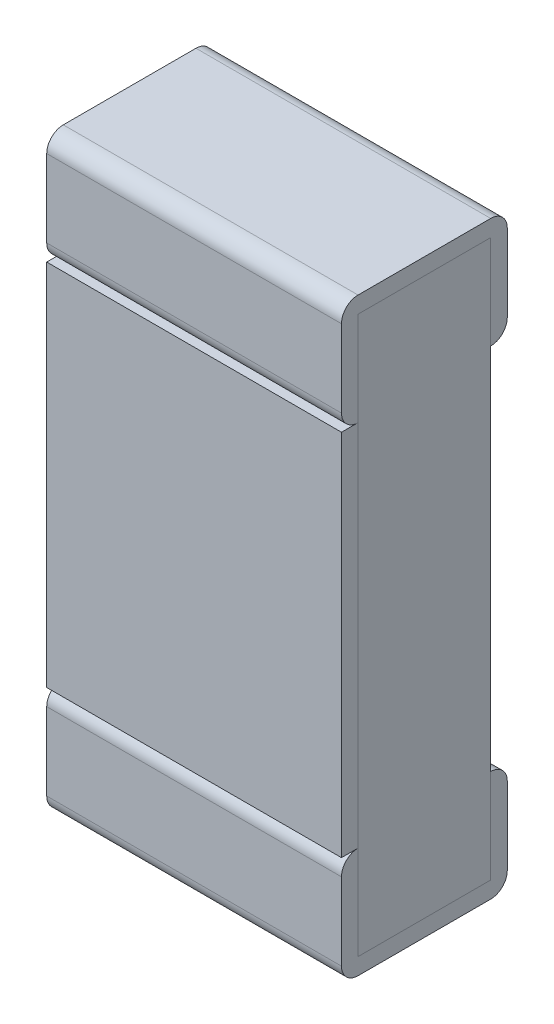
ISO-10303-21;
HEADER;
FILE_DESCRIPTION(('STEP AP214'),'2;1');
FILE_NAME('part.step','',(''),(''),'','','');
FILE_SCHEMA(('AUTOMOTIVE_DESIGN { 1 0 10303 214 1 1 1 1 }'));
ENDSEC;
DATA;
#1=APPLICATION_CONTEXT('core data for automotive mechanical design processes');
#2=APPLICATION_PROTOCOL_DEFINITION('international standard','automotive_design',2000,#1);
#3=PRODUCT_CONTEXT('',#1,'mechanical');
#4=PRODUCT('Part','Part','',(#3));
#5=PRODUCT_RELATED_PRODUCT_CATEGORY('part','',(#4));
#6=PRODUCT_DEFINITION_FORMATION('','',#4);
#7=PRODUCT_DEFINITION_CONTEXT('part definition',#1,'design');
#8=PRODUCT_DEFINITION('design','',#6,#7);
#9=PRODUCT_DEFINITION_SHAPE('','',#8);
#10=(LENGTH_UNIT() NAMED_UNIT(*) SI_UNIT(.MILLI.,.METRE.));
#11=(NAMED_UNIT(*) PLANE_ANGLE_UNIT() SI_UNIT($,.RADIAN.));
#12=(NAMED_UNIT(*) SI_UNIT($,.STERADIAN.) SOLID_ANGLE_UNIT());
#13=UNCERTAINTY_MEASURE_WITH_UNIT(LENGTH_MEASURE(1.E-05),#10,'distance_accuracy_value','');
#14=(GEOMETRIC_REPRESENTATION_CONTEXT(3) GLOBAL_UNCERTAINTY_ASSIGNED_CONTEXT((#13)) GLOBAL_UNIT_ASSIGNED_CONTEXT((#10,
#11,#12)) REPRESENTATION_CONTEXT('',''));
#15=CARTESIAN_POINT('',(0.,0.,0.));
#16=DIRECTION('',(0.,0.,1.));
#17=DIRECTION('',(1.,0.,0.));
#18=AXIS2_PLACEMENT_3D('',#15,#16,#17);
#19=CARTESIAN_POINT('',(148.430744279938,106.47204329235,142.661582908599));
#20=DIRECTION('',(0.,0.,1.));
#21=DIRECTION('',(1.,0.,0.));
#22=AXIS2_PLACEMENT_3D('',#19,#20,#21);
#23=PLANE('',#22);
#24=DIRECTION('',(1.,0.,0.));
#25=VECTOR('',#24,1.);
#26=CARTESIAN_POINT('',(148.430744279938,106.47204329235,142.661582908599));
#27=LINE('',#26,#25);
#28=CARTESIAN_POINT('',(148.430744279938,106.47204329235,142.661582908599));
#29=VERTEX_POINT('',#28);
#30=CARTESIAN_POINT('',(149.230744279938,106.47204329235,142.661582908599));
#31=VERTEX_POINT('',#30);
#32=EDGE_CURVE('E67',#29,#31,#27,.T.);
#33=ORIENTED_EDGE('',*,*,#32,.F.);
#34=DIRECTION('',(0.,-1.,0.));
#35=VECTOR('',#34,1.);
#36=CARTESIAN_POINT('',(148.430744279938,106.47204329235,142.661582908599));
#37=LINE('',#36,#35);
#38=CARTESIAN_POINT('',(148.430744279938,105.47204329235,142.661582908599));
#39=VERTEX_POINT('',#38);
#40=EDGE_CURVE('E11',#29,#39,#37,.T.);
#41=ORIENTED_EDGE('',*,*,#40,.T.);
#42=DIRECTION('',(1.,0.,0.));
#43=VECTOR('',#42,1.);
#44=CARTESIAN_POINT('',(148.430744279938,105.47204329235,142.661582908599));
#45=LINE('',#44,#43);
#46=CARTESIAN_POINT('',(149.230744279938,105.47204329235,142.661582908599));
#47=VERTEX_POINT('',#46);
#48=EDGE_CURVE('E55',#39,#47,#45,.T.);
#49=ORIENTED_EDGE('',*,*,#48,.T.);
#50=DIRECTION('',(0.,-1.,0.));
#51=VECTOR('',#50,1.);
#52=CARTESIAN_POINT('',(149.230744279938,106.47204329235,142.661582908599));
#53=LINE('',#52,#51);
#54=EDGE_CURVE('E330',#31,#47,#53,.T.);
#55=ORIENTED_EDGE('',*,*,#54,.F.);
#56=EDGE_LOOP('',(#33,#41,#49,#55));
#57=FACE_BOUND('',#56,.T.);
#58=ADVANCED_FACE('F44',(#57),#23,.T.);
#59=CARTESIAN_POINT('',(148.430744279938,105.47204329235,142.616582908599));
#60=DIRECTION('',(0.,-1.,0.));
#61=DIRECTION('',(0.,0.,-1.));
#62=AXIS2_PLACEMENT_3D('',#59,#60,#61);
#63=PLANE('',#62);
#64=DIRECTION('',(0.,0.,1.));
#65=VECTOR('',#64,1.);
#66=CARTESIAN_POINT('',(148.430744279938,105.47204329235,142.616582908599));
#67=LINE('',#66,#65);
#68=CARTESIAN_POINT('',(148.430744279938,105.47204329235,142.616582908599));
#69=VERTEX_POINT('',#68);
#70=EDGE_CURVE('E281',#69,#39,#67,.T.);
#71=ORIENTED_EDGE('',*,*,#70,.F.);
#72=DIRECTION('',(1.,0.,0.));
#73=VECTOR('',#72,1.);
#74=CARTESIAN_POINT('',(148.430744279938,105.47204329235,142.616582908599));
#75=LINE('',#74,#73);
#76=CARTESIAN_POINT('',(149.230744279938,105.47204329235,142.616582908599));
#77=VERTEX_POINT('',#76);
#78=EDGE_CURVE('E263',#69,#77,#75,.T.);
#79=ORIENTED_EDGE('',*,*,#78,.T.);
#80=DIRECTION('',(0.,0.,1.));
#81=VECTOR('',#80,1.);
#82=CARTESIAN_POINT('',(149.230744279938,105.47204329235,142.616582908599));
#83=LINE('',#82,#81);
#84=EDGE_CURVE('E259',#77,#47,#83,.T.);
#85=ORIENTED_EDGE('',*,*,#84,.T.);
#86=ORIENTED_EDGE('',*,*,#48,.F.);
#87=EDGE_LOOP('',(#71,#79,#85,#86));
#88=FACE_BOUND('',#87,.T.);
#89=ADVANCED_FACE('F528',(#88),#63,.T.);
#90=CARTESIAN_POINT('',(148.430744279938,105.42704329235,142.616582908599));
#91=DIRECTION('',(1.,0.,0.));
#92=DIRECTION('',(0.,1.,0.));
#93=AXIS2_PLACEMENT_3D('',#90,#91,#92);
#94=CYLINDRICAL_SURFACE('',#93,0.0450000000000034);
#95=CARTESIAN_POINT('',(148.430744279938,105.42704329235,142.616582908599));
#96=DIRECTION('',(1.,0.,0.));
#97=DIRECTION('',(0.,0.,1.));
#98=AXIS2_PLACEMENT_3D('',#95,#96,#97);
#99=CIRCLE('',#98,0.0449999999999895);
#100=CARTESIAN_POINT('',(148.430744279938,105.42704329235,142.661582908599));
#101=VERTEX_POINT('',#100);
#102=EDGE_CURVE('E264',#69,#101,#99,.T.);
#103=ORIENTED_EDGE('',*,*,#102,.T.);
#104=DIRECTION('',(1.,0.,0.));
#105=VECTOR('',#104,1.);
#106=CARTESIAN_POINT('',(148.430744279938,105.42704329235,142.661582908599));
#107=LINE('',#106,#105);
#108=CARTESIAN_POINT('',(149.230744279938,105.42704329235,142.661582908599));
#109=VERTEX_POINT('',#108);
#110=EDGE_CURVE('E338',#101,#109,#107,.T.);
#111=ORIENTED_EDGE('',*,*,#110,.T.);
#112=CARTESIAN_POINT('',(149.230744279938,105.42704329235,142.616582908599));
#113=DIRECTION('',(1.,0.,0.));
#114=DIRECTION('',(0.,0.,1.));
#115=AXIS2_PLACEMENT_3D('',#112,#113,#114);
#116=CIRCLE('',#115,0.0449999999999895);
#117=EDGE_CURVE('E254',#77,#109,#116,.T.);
#118=ORIENTED_EDGE('',*,*,#117,.F.);
#119=ORIENTED_EDGE('',*,*,#78,.F.);
#120=EDGE_LOOP('',(#103,#111,#118,#119));
#121=FACE_BOUND('',#120,.T.);
#122=ADVANCED_FACE('F578',(#121),#94,.T.);
#123=CARTESIAN_POINT('',(148.430744279938,105.47204329235,142.661582908599));
#124=DIRECTION('',(0.,0.,1.));
#125=DIRECTION('',(1.,0.,0.));
#126=AXIS2_PLACEMENT_3D('',#123,#124,#125);
#127=PLANE('',#126);
#128=DIRECTION('',(0.,-1.,0.));
#129=VECTOR('',#128,1.);
#130=CARTESIAN_POINT('',(149.230744279938,105.47204329235,142.661582908599));
#131=LINE('',#130,#129);
#132=CARTESIAN_POINT('',(149.230744279938,105.21704329235,142.661582908599));
#133=VERTEX_POINT('',#132);
#134=EDGE_CURVE('E258',#109,#133,#131,.T.);
#135=ORIENTED_EDGE('',*,*,#134,.F.);
#136=ORIENTED_EDGE('',*,*,#110,.F.);
#137=DIRECTION('',(0.,-1.,0.));
#138=VECTOR('',#137,1.);
#139=CARTESIAN_POINT('',(148.430744279938,105.47204329235,142.661582908599));
#140=LINE('',#139,#138);
#141=CARTESIAN_POINT('',(148.430744279938,105.21704329235,142.661582908599));
#142=VERTEX_POINT('',#141);
#143=EDGE_CURVE('E375',#101,#142,#140,.T.);
#144=ORIENTED_EDGE('',*,*,#143,.T.);
#145=DIRECTION('',(1.,0.,0.));
#146=VECTOR('',#145,1.);
#147=CARTESIAN_POINT('',(148.430744279938,105.21704329235,142.661582908599));
#148=LINE('',#147,#146);
#149=EDGE_CURVE('E269',#142,#133,#148,.T.);
#150=ORIENTED_EDGE('',*,*,#149,.T.);
#151=EDGE_LOOP('',(#135,#136,#144,#150));
#152=FACE_BOUND('',#151,.T.);
#153=ADVANCED_FACE('F580',(#152),#127,.T.);
#154=CARTESIAN_POINT('',(148.430744279938,105.21704329235,142.616582908599));
#155=DIRECTION('',(1.,0.,0.));
#156=DIRECTION('',(0.,-1.,0.));
#157=AXIS2_PLACEMENT_3D('',#154,#155,#156);
#158=CYLINDRICAL_SURFACE('',#157,0.0450000000000034);
#159=DIRECTION('',(1.,0.,0.));
#160=VECTOR('',#159,1.);
#161=CARTESIAN_POINT('',(148.430744279938,105.17204329235,142.616582908599));
#162=LINE('',#161,#160);
#163=CARTESIAN_POINT('',(148.430744279938,105.17204329235,142.616582908599));
#164=VERTEX_POINT('',#163);
#165=CARTESIAN_POINT('',(149.230744279938,105.17204329235,142.616582908599));
#166=VERTEX_POINT('',#165);
#167=EDGE_CURVE('E265',#164,#166,#162,.T.);
#168=ORIENTED_EDGE('',*,*,#167,.T.);
#169=CARTESIAN_POINT('',(149.230744279938,105.21704329235,142.616582908599));
#170=DIRECTION('',(-1.,0.,0.));
#171=DIRECTION('',(0.,0.,1.));
#172=AXIS2_PLACEMENT_3D('',#169,#170,#171);
#173=CIRCLE('',#172,0.0449999999999895);
#174=EDGE_CURVE('E270',#166,#133,#173,.T.);
#175=ORIENTED_EDGE('',*,*,#174,.T.);
#176=ORIENTED_EDGE('',*,*,#149,.F.);
#177=CARTESIAN_POINT('',(148.430744279938,105.21704329235,142.616582908599));
#178=DIRECTION('',(-1.,0.,0.));
#179=DIRECTION('',(0.,0.,1.));
#180=AXIS2_PLACEMENT_3D('',#177,#178,#179);
#181=CIRCLE('',#180,0.0449999999999895);
#182=EDGE_CURVE('E295',#164,#142,#181,.T.);
#183=ORIENTED_EDGE('',*,*,#182,.F.);
#184=EDGE_LOOP('',(#168,#175,#176,#183));
#185=FACE_BOUND('',#184,.T.);
#186=ADVANCED_FACE('F560',(#185),#158,.T.);
#187=CARTESIAN_POINT('',(148.430744279938,105.17204329235,142.211582908599));
#188=DIRECTION('',(0.,-1.,0.));
#189=DIRECTION('',(0.,0.,-1.));
#190=AXIS2_PLACEMENT_3D('',#187,#188,#189);
#191=PLANE('',#190);
#192=DIRECTION('',(0.,0.,1.));
#193=VECTOR('',#192,1.);
#194=CARTESIAN_POINT('',(148.430744279938,105.17204329235,142.211582908599));
#195=LINE('',#194,#193);
#196=CARTESIAN_POINT('',(148.430744279938,105.17204329235,142.256582908599));
#197=VERTEX_POINT('',#196);
#198=EDGE_CURVE('E282',#197,#164,#195,.T.);
#199=ORIENTED_EDGE('',*,*,#198,.F.);
#200=DIRECTION('',(1.,0.,0.));
#201=VECTOR('',#200,1.);
#202=CARTESIAN_POINT('',(148.430744279938,105.17204329235,142.256582908599));
#203=LINE('',#202,#201);
#204=CARTESIAN_POINT('',(149.230744279938,105.17204329235,142.256582908599));
#205=VERTEX_POINT('',#204);
#206=EDGE_CURVE('E308',#197,#205,#203,.T.);
#207=ORIENTED_EDGE('',*,*,#206,.T.);
#208=DIRECTION('',(0.,0.,1.));
#209=VECTOR('',#208,1.);
#210=CARTESIAN_POINT('',(149.230744279938,105.17204329235,142.211582908599));
#211=LINE('',#210,#209);
#212=EDGE_CURVE('E355',#205,#166,#211,.T.);
#213=ORIENTED_EDGE('',*,*,#212,.T.);
#214=ORIENTED_EDGE('',*,*,#167,.F.);
#215=EDGE_LOOP('',(#199,#207,#213,#214));
#216=FACE_BOUND('',#215,.T.);
#217=ADVANCED_FACE('F564',(#216),#191,.T.);
#218=CARTESIAN_POINT('',(148.430744279938,105.21704329235,142.256582908599));
#219=DIRECTION('',(1.,0.,0.));
#220=DIRECTION('',(0.,-1.,0.));
#221=AXIS2_PLACEMENT_3D('',#218,#219,#220);
#222=CYLINDRICAL_SURFACE('',#221,0.0450000000000034);
#223=CARTESIAN_POINT('',(148.430744279938,105.21704329235,142.256582908599));
#224=DIRECTION('',(1.,0.,0.));
#225=DIRECTION('',(0.,0.,1.));
#226=AXIS2_PLACEMENT_3D('',#223,#224,#225);
#227=CIRCLE('',#226,0.0449999999999895);
#228=CARTESIAN_POINT('',(148.430744279938,105.21704329235,142.211582908599));
#229=VERTEX_POINT('',#228);
#230=EDGE_CURVE('E389',#197,#229,#227,.T.);
#231=ORIENTED_EDGE('',*,*,#230,.T.);
#232=DIRECTION('',(1.,0.,0.));
#233=VECTOR('',#232,1.);
#234=CARTESIAN_POINT('',(148.430744279938,105.21704329235,142.211582908599));
#235=LINE('',#234,#233);
#236=CARTESIAN_POINT('',(149.230744279938,105.21704329235,142.211582908599));
#237=VERTEX_POINT('',#236);
#238=EDGE_CURVE('E366',#229,#237,#235,.T.);
#239=ORIENTED_EDGE('',*,*,#238,.T.);
#240=CARTESIAN_POINT('',(149.230744279938,105.21704329235,142.256582908599));
#241=DIRECTION('',(1.,0.,0.));
#242=DIRECTION('',(0.,0.,1.));
#243=AXIS2_PLACEMENT_3D('',#240,#241,#242);
#244=CIRCLE('',#243,0.0449999999999895);
#245=EDGE_CURVE('E374',#205,#237,#244,.T.);
#246=ORIENTED_EDGE('',*,*,#245,.F.);
#247=ORIENTED_EDGE('',*,*,#206,.F.);
#248=EDGE_LOOP('',(#231,#239,#246,#247));
#249=FACE_BOUND('',#248,.T.);
#250=ADVANCED_FACE('F422',(#249),#222,.T.);
#251=CARTESIAN_POINT('',(148.430744279938,105.47204329235,142.211582908599));
#252=DIRECTION('',(0.,0.,1.));
#253=DIRECTION('',(1.,0.,0.));
#254=AXIS2_PLACEMENT_3D('',#251,#252,#253);
#255=PLANE('',#254);
#256=ORIENTED_EDGE('',*,*,#238,.F.);
#257=DIRECTION('',(0.,-1.,0.));
#258=VECTOR('',#257,1.);
#259=CARTESIAN_POINT('',(148.430744279938,105.47204329235,142.211582908599));
#260=LINE('',#259,#258);
#261=CARTESIAN_POINT('',(148.430744279938,105.42704329235,142.211582908599));
#262=VERTEX_POINT('',#261);
#263=EDGE_CURVE('E309',#262,#229,#260,.T.);
#264=ORIENTED_EDGE('',*,*,#263,.F.);
#265=DIRECTION('',(1.,0.,0.));
#266=VECTOR('',#265,1.);
#267=CARTESIAN_POINT('',(148.430744279938,105.42704329235,142.211582908599));
#268=LINE('',#267,#266);
#269=CARTESIAN_POINT('',(149.230744279938,105.42704329235,142.211582908599));
#270=VERTEX_POINT('',#269);
#271=EDGE_CURVE('E362',#262,#270,#268,.T.);
#272=ORIENTED_EDGE('',*,*,#271,.T.);
#273=DIRECTION('',(0.,-1.,0.));
#274=VECTOR('',#273,1.);
#275=CARTESIAN_POINT('',(149.230744279938,105.47204329235,142.211582908599));
#276=LINE('',#275,#274);
#277=EDGE_CURVE('E367',#270,#237,#276,.T.);
#278=ORIENTED_EDGE('',*,*,#277,.T.);
#279=EDGE_LOOP('',(#256,#264,#272,#278));
#280=FACE_BOUND('',#279,.T.);
#281=ADVANCED_FACE('F431',(#280),#255,.F.);
#282=CARTESIAN_POINT('',(148.430744279938,105.42704329235,142.256582908599));
#283=DIRECTION('',(1.,0.,0.));
#284=DIRECTION('',(0.,1.,0.));
#285=AXIS2_PLACEMENT_3D('',#282,#283,#284);
#286=CYLINDRICAL_SURFACE('',#285,0.0450000000000034);
#287=DIRECTION('',(1.,0.,0.));
#288=VECTOR('',#287,1.);
#289=CARTESIAN_POINT('',(148.430744279938,105.47204329235,142.256582908599));
#290=LINE('',#289,#288);
#291=CARTESIAN_POINT('',(148.430744279938,105.47204329235,142.256582908599));
#292=VERTEX_POINT('',#291);
#293=CARTESIAN_POINT('',(149.230744279938,105.47204329235,142.256582908599));
#294=VERTEX_POINT('',#293);
#295=EDGE_CURVE('E325',#292,#294,#290,.T.);
#296=ORIENTED_EDGE('',*,*,#295,.T.);
#297=CARTESIAN_POINT('',(149.230744279938,105.42704329235,142.256582908599));
#298=DIRECTION('',(-1.,0.,0.));
#299=DIRECTION('',(0.,0.,1.));
#300=AXIS2_PLACEMENT_3D('',#297,#298,#299);
#301=CIRCLE('',#300,0.0449999999999895);
#302=EDGE_CURVE('E321',#294,#270,#301,.T.);
#303=ORIENTED_EDGE('',*,*,#302,.T.);
#304=ORIENTED_EDGE('',*,*,#271,.F.);
#305=CARTESIAN_POINT('',(148.430744279938,105.42704329235,142.256582908599));
#306=DIRECTION('',(-1.,0.,0.));
#307=DIRECTION('',(0.,0.,1.));
#308=AXIS2_PLACEMENT_3D('',#305,#306,#307);
#309=CIRCLE('',#308,0.0449999999999895);
#310=EDGE_CURVE('E313',#292,#262,#309,.T.);
#311=ORIENTED_EDGE('',*,*,#310,.F.);
#312=EDGE_LOOP('',(#296,#303,#304,#311));
#313=FACE_BOUND('',#312,.T.);
#314=ADVANCED_FACE('F470',(#313),#286,.T.);
#315=CARTESIAN_POINT('',(149.230744279938,106.47204329235,142.616582908599));
#316=DIRECTION('',(1.,0.,0.));
#317=DIRECTION('',(0.,1.,0.));
#318=AXIS2_PLACEMENT_3D('',#315,#316,#317);
#319=PLANE('',#318);
#320=DIRECTION('',(0.,-1.,0.));
#321=VECTOR('',#320,1.);
#322=CARTESIAN_POINT('',(149.230744279938,106.47204329235,142.616582908599));
#323=LINE('',#322,#321);
#324=CARTESIAN_POINT('',(149.230744279938,106.47204329235,142.616582908599));
#325=VERTEX_POINT('',#324);
#326=EDGE_CURVE('E339',#325,#77,#323,.T.);
#327=ORIENTED_EDGE('',*,*,#326,.F.);
#328=DIRECTION('',(0.,0.,1.));
#329=VECTOR('',#328,1.);
#330=CARTESIAN_POINT('',(149.230744279938,106.47204329235,142.616582908599));
#331=LINE('',#330,#329);
#332=EDGE_CURVE('E326',#325,#31,#331,.T.);
#333=ORIENTED_EDGE('',*,*,#332,.T.);
#334=ORIENTED_EDGE('',*,*,#54,.T.);
#335=ORIENTED_EDGE('',*,*,#84,.F.);
#336=EDGE_LOOP('',(#327,#333,#334,#335));
#337=FACE_BOUND('',#336,.T.);
#338=ADVANCED_FACE('F532',(#337),#319,.T.);
#339=CARTESIAN_POINT('',(149.230744279938,105.47204329235,142.211582908599));
#340=DIRECTION('',(1.,0.,0.));
#341=DIRECTION('',(0.,1.,0.));
#342=AXIS2_PLACEMENT_3D('',#339,#340,#341);
#343=PLANE('',#342);
#344=ORIENTED_EDGE('',*,*,#277,.F.);
#345=ORIENTED_EDGE('',*,*,#302,.F.);
#346=DIRECTION('',(0.,-1.,0.));
#347=VECTOR('',#346,1.);
#348=CARTESIAN_POINT('',(149.230744279938,106.72704329235,142.256582908599));
#349=LINE('',#348,#347);
#350=CARTESIAN_POINT('',(149.230744279938,105.21704329235,142.256582908599));
#351=VERTEX_POINT('',#350);
#352=EDGE_CURVE('E161',#294,#351,#349,.T.);
#353=ORIENTED_EDGE('',*,*,#352,.T.);
#354=DIRECTION('',(0.,0.,1.));
#355=VECTOR('',#354,1.);
#356=CARTESIAN_POINT('',(149.230744279938,105.21704329235,142.256582908599));
#357=LINE('',#356,#355);
#358=CARTESIAN_POINT('',(149.230744279938,105.21704329235,142.616582908599));
#359=VERTEX_POINT('',#358);
#360=EDGE_CURVE('E257',#351,#359,#357,.T.);
#361=ORIENTED_EDGE('',*,*,#360,.T.);
#362=DIRECTION('',(0.,-1.,0.));
#363=VECTOR('',#362,1.);
#364=CARTESIAN_POINT('',(149.230744279938,106.72704329235,142.616582908599));
#365=LINE('',#364,#363);
#366=EDGE_CURVE('E343',#77,#359,#365,.T.);
#367=ORIENTED_EDGE('',*,*,#366,.F.);
#368=ORIENTED_EDGE('',*,*,#117,.T.);
#369=ORIENTED_EDGE('',*,*,#134,.T.);
#370=ORIENTED_EDGE('',*,*,#174,.F.);
#371=ORIENTED_EDGE('',*,*,#212,.F.);
#372=ORIENTED_EDGE('',*,*,#245,.T.);
#373=EDGE_LOOP('',(#344,#345,#353,#361,#367,#368,#369,#370,#371,#372));
#374=FACE_BOUND('',#373,.T.);
#375=ADVANCED_FACE('F581',(#374),#343,.T.);
#376=CARTESIAN_POINT('',(148.430744279938,106.47204329235,142.616582908599));
#377=DIRECTION('',(0.,-1.,0.));
#378=DIRECTION('',(0.,0.,-1.));
#379=AXIS2_PLACEMENT_3D('',#376,#377,#378);
#380=PLANE('',#379);
#381=ORIENTED_EDGE('',*,*,#32,.T.);
#382=ORIENTED_EDGE('',*,*,#332,.F.);
#383=DIRECTION('',(1.,0.,0.));
#384=VECTOR('',#383,1.);
#385=CARTESIAN_POINT('',(148.430744279938,106.47204329235,142.616582908599));
#386=LINE('',#385,#384);
#387=CARTESIAN_POINT('',(148.430744279938,106.47204329235,142.616582908599));
#388=VERTEX_POINT('',#387);
#389=EDGE_CURVE('E149',#388,#325,#386,.T.);
#390=ORIENTED_EDGE('',*,*,#389,.F.);
#391=DIRECTION('',(0.,0.,1.));
#392=VECTOR('',#391,1.);
#393=CARTESIAN_POINT('',(148.430744279938,106.47204329235,142.616582908599));
#394=LINE('',#393,#392);
#395=EDGE_CURVE('E291',#388,#29,#394,.T.);
#396=ORIENTED_EDGE('',*,*,#395,.T.);
#397=EDGE_LOOP('',(#381,#382,#390,#396));
#398=FACE_BOUND('',#397,.T.);
#399=ADVANCED_FACE('F524',(#398),#380,.F.);
#400=CARTESIAN_POINT('',(148.430744279938,106.47204329235,142.616582908599));
#401=DIRECTION('',(1.,0.,0.));
#402=DIRECTION('',(0.,1.,0.));
#403=AXIS2_PLACEMENT_3D('',#400,#401,#402);
#404=PLANE('',#403);
#405=ORIENTED_EDGE('',*,*,#70,.T.);
#406=ORIENTED_EDGE('',*,*,#40,.F.);
#407=ORIENTED_EDGE('',*,*,#395,.F.);
#408=DIRECTION('',(0.,-1.,0.));
#409=VECTOR('',#408,1.);
#410=CARTESIAN_POINT('',(148.430744279938,106.47204329235,142.616582908599));
#411=LINE('',#410,#409);
#412=EDGE_CURVE('E278',#388,#69,#411,.T.);
#413=ORIENTED_EDGE('',*,*,#412,.T.);
#414=EDGE_LOOP('',(#405,#406,#407,#413));
#415=FACE_BOUND('',#414,.T.);
#416=ADVANCED_FACE('F525',(#415),#404,.F.);
#417=CARTESIAN_POINT('',(148.430744279938,105.47204329235,142.211582908599));
#418=DIRECTION('',(1.,0.,0.));
#419=DIRECTION('',(0.,1.,0.));
#420=AXIS2_PLACEMENT_3D('',#417,#418,#419);
#421=PLANE('',#420);
#422=ORIENTED_EDGE('',*,*,#230,.F.);
#423=ORIENTED_EDGE('',*,*,#198,.T.);
#424=ORIENTED_EDGE('',*,*,#182,.T.);
#425=ORIENTED_EDGE('',*,*,#143,.F.);
#426=ORIENTED_EDGE('',*,*,#102,.F.);
#427=DIRECTION('',(0.,-1.,0.));
#428=VECTOR('',#427,1.);
#429=CARTESIAN_POINT('',(148.430744279938,106.72704329235,142.616582908599));
#430=LINE('',#429,#428);
#431=CARTESIAN_POINT('',(148.430744279938,105.21704329235,142.616582908599));
#432=VERTEX_POINT('',#431);
#433=EDGE_CURVE('E217',#69,#432,#430,.T.);
#434=ORIENTED_EDGE('',*,*,#433,.T.);
#435=DIRECTION('',(0.,0.,1.));
#436=VECTOR('',#435,1.);
#437=CARTESIAN_POINT('',(148.430744279938,105.21704329235,142.256582908599));
#438=LINE('',#437,#436);
#439=CARTESIAN_POINT('',(148.430744279938,105.21704329235,142.256582908599));
#440=VERTEX_POINT('',#439);
#441=EDGE_CURVE('E208',#440,#432,#438,.T.);
#442=ORIENTED_EDGE('',*,*,#441,.F.);
#443=DIRECTION('',(0.,-1.,0.));
#444=VECTOR('',#443,1.);
#445=CARTESIAN_POINT('',(148.430744279938,106.72704329235,142.256582908599));
#446=LINE('',#445,#444);
#447=EDGE_CURVE('E213',#292,#440,#446,.T.);
#448=ORIENTED_EDGE('',*,*,#447,.F.);
#449=ORIENTED_EDGE('',*,*,#310,.T.);
#450=ORIENTED_EDGE('',*,*,#263,.T.);
#451=EDGE_LOOP('',(#422,#423,#424,#425,#426,#434,#442,#448,#449,#450));
#452=FACE_BOUND('',#451,.T.);
#453=ADVANCED_FACE('F211',(#452),#421,.F.);
#454=CARTESIAN_POINT('',(148.430744279938,106.72704329235,142.256582908599));
#455=DIRECTION('',(0.,0.,1.));
#456=DIRECTION('',(1.,0.,0.));
#457=AXIS2_PLACEMENT_3D('',#454,#455,#456);
#458=PLANE('',#457);
#459=DIRECTION('',(0.,-1.,0.));
#460=VECTOR('',#459,1.);
#461=CARTESIAN_POINT('',(149.230744279938,106.72704329235,142.256582908599));
#462=LINE('',#461,#460);
#463=CARTESIAN_POINT('',(149.230744279938,106.47204329235,142.256582908599));
#464=VERTEX_POINT('',#463);
#465=EDGE_CURVE('E314',#464,#294,#462,.T.);
#466=ORIENTED_EDGE('',*,*,#465,.T.);
#467=ORIENTED_EDGE('',*,*,#295,.F.);
#468=DIRECTION('',(0.,-1.,0.));
#469=VECTOR('',#468,1.);
#470=CARTESIAN_POINT('',(148.430744279938,106.72704329235,142.256582908599));
#471=LINE('',#470,#469);
#472=CARTESIAN_POINT('',(148.430744279938,106.47204329235,142.256582908599));
#473=VERTEX_POINT('',#472);
#474=EDGE_CURVE('E225',#473,#292,#471,.T.);
#475=ORIENTED_EDGE('',*,*,#474,.F.);
#476=DIRECTION('',(1.,0.,0.));
#477=VECTOR('',#476,1.);
#478=CARTESIAN_POINT('',(148.430744279938,106.47204329235,142.256582908599));
#479=LINE('',#478,#477);
#480=EDGE_CURVE('E403',#473,#464,#479,.T.);
#481=ORIENTED_EDGE('',*,*,#480,.T.);
#482=EDGE_LOOP('',(#466,#467,#475,#481));
#483=FACE_BOUND('',#482,.T.);
#484=ADVANCED_FACE('F472',(#483),#458,.F.);
#485=CARTESIAN_POINT('',(149.230744279938,106.72704329235,142.256582908599));
#486=DIRECTION('',(1.,0.,0.));
#487=DIRECTION('',(0.,1.,0.));
#488=AXIS2_PLACEMENT_3D('',#485,#486,#487);
#489=PLANE('',#488);
#490=DIRECTION('',(0.,-1.,0.));
#491=VECTOR('',#490,1.);
#492=CARTESIAN_POINT('',(149.230744279938,106.72704329235,142.256582908599));
#493=LINE('',#492,#491);
#494=CARTESIAN_POINT('',(149.230744279938,106.72704329235,142.256582908599));
#495=VERTEX_POINT('',#494);
#496=EDGE_CURVE('E247',#495,#464,#493,.T.);
#497=ORIENTED_EDGE('',*,*,#496,.F.);
#498=DIRECTION('',(0.,0.,1.));
#499=VECTOR('',#498,1.);
#500=CARTESIAN_POINT('',(149.230744279938,106.72704329235,142.256582908599));
#501=LINE('',#500,#499);
#502=CARTESIAN_POINT('',(149.230744279938,106.72704329235,142.616582908599));
#503=VERTEX_POINT('',#502);
#504=EDGE_CURVE('E399',#495,#503,#501,.T.);
#505=ORIENTED_EDGE('',*,*,#504,.T.);
#506=DIRECTION('',(0.,-1.,0.));
#507=VECTOR('',#506,1.);
#508=CARTESIAN_POINT('',(149.230744279938,106.72704329235,142.616582908599));
#509=LINE('',#508,#507);
#510=EDGE_CURVE('E342',#503,#325,#509,.T.);
#511=ORIENTED_EDGE('',*,*,#510,.T.);
#512=ORIENTED_EDGE('',*,*,#326,.T.);
#513=ORIENTED_EDGE('',*,*,#366,.T.);
#514=ORIENTED_EDGE('',*,*,#360,.F.);
#515=ORIENTED_EDGE('',*,*,#352,.F.);
#516=ORIENTED_EDGE('',*,*,#465,.F.);
#517=EDGE_LOOP('',(#497,#505,#511,#512,#513,#514,#515,#516));
#518=FACE_BOUND('',#517,.T.);
#519=ADVANCED_FACE('F478',(#518),#489,.T.);
#520=CARTESIAN_POINT('',(148.430744279938,106.51704329235,142.616582908599));
#521=DIRECTION('',(1.,0.,0.));
#522=DIRECTION('',(0.,-1.,0.));
#523=AXIS2_PLACEMENT_3D('',#520,#521,#522);
#524=CYLINDRICAL_SURFACE('',#523,0.0450000000000034);
#525=ORIENTED_EDGE('',*,*,#389,.T.);
#526=CARTESIAN_POINT('',(149.230744279938,106.51704329235,142.616582908599));
#527=DIRECTION('',(-1.,0.,0.));
#528=DIRECTION('',(0.,0.,1.));
#529=AXIS2_PLACEMENT_3D('',#526,#527,#528);
#530=CIRCLE('',#529,0.0449999999999895);
#531=CARTESIAN_POINT('',(149.230744279938,106.51704329235,142.661582908599));
#532=VERTEX_POINT('',#531);
#533=EDGE_CURVE('E407',#325,#532,#530,.T.);
#534=ORIENTED_EDGE('',*,*,#533,.T.);
#535=DIRECTION('',(1.,0.,0.));
#536=VECTOR('',#535,1.);
#537=CARTESIAN_POINT('',(148.430744279938,106.51704329235,142.661582908599));
#538=LINE('',#537,#536);
#539=CARTESIAN_POINT('',(148.430744279938,106.51704329235,142.661582908599));
#540=VERTEX_POINT('',#539);
#541=EDGE_CURVE('E232',#540,#532,#538,.T.);
#542=ORIENTED_EDGE('',*,*,#541,.F.);
#543=CARTESIAN_POINT('',(148.430744279938,106.51704329235,142.616582908599));
#544=DIRECTION('',(-1.,0.,0.));
#545=DIRECTION('',(0.,0.,1.));
#546=AXIS2_PLACEMENT_3D('',#543,#544,#545);
#547=CIRCLE('',#546,0.0449999999999895);
#548=EDGE_CURVE('E271',#388,#540,#547,.T.);
#549=ORIENTED_EDGE('',*,*,#548,.F.);
#550=EDGE_LOOP('',(#525,#534,#542,#549));
#551=FACE_BOUND('',#550,.T.);
#552=ADVANCED_FACE('F46',(#551),#524,.T.);
#553=CARTESIAN_POINT('',(148.430744279938,106.77204329235,142.661582908599));
#554=DIRECTION('',(0.,0.,1.));
#555=DIRECTION('',(1.,0.,0.));
#556=AXIS2_PLACEMENT_3D('',#553,#554,#555);
#557=PLANE('',#556);
#558=DIRECTION('',(0.,-1.,0.));
#559=VECTOR('',#558,1.);
#560=CARTESIAN_POINT('',(149.230744279938,106.77204329235,142.661582908599));
#561=LINE('',#560,#559);
#562=CARTESIAN_POINT('',(149.230744279938,106.72704329235,142.661582908599));
#563=VERTEX_POINT('',#562);
#564=EDGE_CURVE('E242',#563,#532,#561,.T.);
#565=ORIENTED_EDGE('',*,*,#564,.F.);
#566=DIRECTION('',(1.,0.,0.));
#567=VECTOR('',#566,1.);
#568=CARTESIAN_POINT('',(148.430744279938,106.72704329235,142.661582908599));
#569=LINE('',#568,#567);
#570=CARTESIAN_POINT('',(148.430744279938,106.72704329235,142.661582908599));
#571=VERTEX_POINT('',#570);
#572=EDGE_CURVE('E240',#571,#563,#569,.T.);
#573=ORIENTED_EDGE('',*,*,#572,.F.);
#574=DIRECTION('',(0.,-1.,0.));
#575=VECTOR('',#574,1.);
#576=CARTESIAN_POINT('',(148.430744279938,106.77204329235,142.661582908599));
#577=LINE('',#576,#575);
#578=EDGE_CURVE('E409',#571,#540,#577,.T.);
#579=ORIENTED_EDGE('',*,*,#578,.T.);
#580=ORIENTED_EDGE('',*,*,#541,.T.);
#581=EDGE_LOOP('',(#565,#573,#579,#580));
#582=FACE_BOUND('',#581,.T.);
#583=ADVANCED_FACE('F504',(#582),#557,.T.);
#584=CARTESIAN_POINT('',(148.430744279938,106.72704329235,142.256582908599));
#585=DIRECTION('',(1.,0.,0.));
#586=DIRECTION('',(0.,1.,0.));
#587=AXIS2_PLACEMENT_3D('',#584,#585,#586);
#588=PLANE('',#587);
#589=ORIENTED_EDGE('',*,*,#474,.T.);
#590=ORIENTED_EDGE('',*,*,#447,.T.);
#591=ORIENTED_EDGE('',*,*,#441,.T.);
#592=ORIENTED_EDGE('',*,*,#433,.F.);
#593=ORIENTED_EDGE('',*,*,#412,.F.);
#594=DIRECTION('',(0.,-1.,0.));
#595=VECTOR('',#594,1.);
#596=CARTESIAN_POINT('',(148.430744279938,106.72704329235,142.616582908599));
#597=LINE('',#596,#595);
#598=CARTESIAN_POINT('',(148.430744279938,106.72704329235,142.616582908599));
#599=VERTEX_POINT('',#598);
#600=EDGE_CURVE('E274',#599,#388,#597,.T.);
#601=ORIENTED_EDGE('',*,*,#600,.F.);
#602=DIRECTION('',(0.,0.,1.));
#603=VECTOR('',#602,1.);
#604=CARTESIAN_POINT('',(148.430744279938,106.72704329235,142.256582908599));
#605=LINE('',#604,#603);
#606=CARTESIAN_POINT('',(148.430744279938,106.72704329235,142.256582908599));
#607=VERTEX_POINT('',#606);
#608=EDGE_CURVE('E368',#607,#599,#605,.T.);
#609=ORIENTED_EDGE('',*,*,#608,.F.);
#610=DIRECTION('',(0.,-1.,0.));
#611=VECTOR('',#610,1.);
#612=CARTESIAN_POINT('',(148.430744279938,106.72704329235,142.256582908599));
#613=LINE('',#612,#611);
#614=EDGE_CURVE('E220',#607,#473,#613,.T.);
#615=ORIENTED_EDGE('',*,*,#614,.T.);
#616=EDGE_LOOP('',(#589,#590,#591,#592,#593,#601,#609,#615));
#617=FACE_BOUND('',#616,.T.);
#618=ADVANCED_FACE('F223',(#617),#588,.F.);
#619=CARTESIAN_POINT('',(148.430744279938,106.51704329235,142.256582908599));
#620=DIRECTION('',(1.,0.,0.));
#621=DIRECTION('',(0.,-1.,0.));
#622=AXIS2_PLACEMENT_3D('',#619,#620,#621);
#623=CYLINDRICAL_SURFACE('',#622,0.0450000000000034);
#624=CARTESIAN_POINT('',(148.430744279938,106.51704329235,142.256582908599));
#625=DIRECTION('',(1.,0.,0.));
#626=DIRECTION('',(0.,0.,1.));
#627=AXIS2_PLACEMENT_3D('',#624,#625,#626);
#628=CIRCLE('',#627,0.0449999999999895);
#629=CARTESIAN_POINT('',(148.430744279938,106.51704329235,142.211582908599));
#630=VERTEX_POINT('',#629);
#631=EDGE_CURVE('E382',#473,#630,#628,.T.);
#632=ORIENTED_EDGE('',*,*,#631,.T.);
#633=DIRECTION('',(1.,0.,0.));
#634=VECTOR('',#633,1.);
#635=CARTESIAN_POINT('',(148.430744279938,106.51704329235,142.211582908599));
#636=LINE('',#635,#634);
#637=CARTESIAN_POINT('',(149.230744279938,106.51704329235,142.211582908599));
#638=VERTEX_POINT('',#637);
#639=EDGE_CURVE('E319',#630,#638,#636,.T.);
#640=ORIENTED_EDGE('',*,*,#639,.T.);
#641=CARTESIAN_POINT('',(149.230744279938,106.51704329235,142.256582908599));
#642=DIRECTION('',(1.,0.,0.));
#643=DIRECTION('',(0.,0.,1.));
#644=AXIS2_PLACEMENT_3D('',#641,#642,#643);
#645=CIRCLE('',#644,0.0449999999999895);
#646=EDGE_CURVE('E48',#464,#638,#645,.T.);
#647=ORIENTED_EDGE('',*,*,#646,.F.);
#648=ORIENTED_EDGE('',*,*,#480,.F.);
#649=EDGE_LOOP('',(#632,#640,#647,#648));
#650=FACE_BOUND('',#649,.T.);
#651=ADVANCED_FACE('F485',(#650),#623,.T.);
#652=CARTESIAN_POINT('',(148.430744279938,106.77204329235,142.211582908599));
#653=DIRECTION('',(0.,0.,1.));
#654=DIRECTION('',(1.,0.,0.));
#655=AXIS2_PLACEMENT_3D('',#652,#653,#654);
#656=PLANE('',#655);
#657=ORIENTED_EDGE('',*,*,#639,.F.);
#658=DIRECTION('',(0.,-1.,0.));
#659=VECTOR('',#658,1.);
#660=CARTESIAN_POINT('',(148.430744279938,106.77204329235,142.211582908599));
#661=LINE('',#660,#659);
#662=CARTESIAN_POINT('',(148.430744279938,106.72704329235,142.211582908599));
#663=VERTEX_POINT('',#662);
#664=EDGE_CURVE('E252',#663,#630,#661,.T.);
#665=ORIENTED_EDGE('',*,*,#664,.F.);
#666=DIRECTION('',(1.,0.,0.));
#667=VECTOR('',#666,1.);
#668=CARTESIAN_POINT('',(148.430744279938,106.72704329235,142.211582908599));
#669=LINE('',#668,#667);
#670=CARTESIAN_POINT('',(149.230744279938,106.72704329235,142.211582908599));
#671=VERTEX_POINT('',#670);
#672=EDGE_CURVE('E315',#663,#671,#669,.T.);
#673=ORIENTED_EDGE('',*,*,#672,.T.);
#674=DIRECTION('',(0.,-1.,0.));
#675=VECTOR('',#674,1.);
#676=CARTESIAN_POINT('',(149.230744279938,106.77204329235,142.211582908599));
#677=LINE('',#676,#675);
#678=EDGE_CURVE('E320',#671,#638,#677,.T.);
#679=ORIENTED_EDGE('',*,*,#678,.T.);
#680=EDGE_LOOP('',(#657,#665,#673,#679));
#681=FACE_BOUND('',#680,.T.);
#682=ADVANCED_FACE('F600',(#681),#656,.F.);
#683=CARTESIAN_POINT('',(149.230744279938,106.77204329235,142.211582908599));
#684=DIRECTION('',(1.,0.,0.));
#685=DIRECTION('',(0.,1.,0.));
#686=AXIS2_PLACEMENT_3D('',#683,#684,#685);
#687=PLANE('',#686);
#688=ORIENTED_EDGE('',*,*,#678,.F.);
#689=CARTESIAN_POINT('',(149.230744279938,106.72704329235,142.256582908599));
#690=DIRECTION('',(-1.,0.,0.));
#691=DIRECTION('',(0.,0.,1.));
#692=AXIS2_PLACEMENT_3D('',#689,#690,#691);
#693=CIRCLE('',#692,0.0449999999999895);
#694=CARTESIAN_POINT('',(149.230744279938,106.77204329235,142.256582908599));
#695=VERTEX_POINT('',#694);
#696=EDGE_CURVE('E241',#695,#671,#693,.T.);
#697=ORIENTED_EDGE('',*,*,#696,.F.);
#698=DIRECTION('',(0.,0.,1.));
#699=VECTOR('',#698,1.);
#700=CARTESIAN_POINT('',(149.230744279938,106.77204329235,142.211582908599));
#701=LINE('',#700,#699);
#702=CARTESIAN_POINT('',(149.230744279938,106.77204329235,142.616582908599));
#703=VERTEX_POINT('',#702);
#704=EDGE_CURVE('E334',#695,#703,#701,.T.);
#705=ORIENTED_EDGE('',*,*,#704,.T.);
#706=CARTESIAN_POINT('',(149.230744279938,106.72704329235,142.616582908599));
#707=DIRECTION('',(1.,0.,0.));
#708=DIRECTION('',(0.,0.,1.));
#709=AXIS2_PLACEMENT_3D('',#706,#707,#708);
#710=CIRCLE('',#709,0.0449999999999895);
#711=EDGE_CURVE('E246',#703,#563,#710,.T.);
#712=ORIENTED_EDGE('',*,*,#711,.T.);
#713=ORIENTED_EDGE('',*,*,#564,.T.);
#714=ORIENTED_EDGE('',*,*,#533,.F.);
#715=ORIENTED_EDGE('',*,*,#510,.F.);
#716=ORIENTED_EDGE('',*,*,#504,.F.);
#717=ORIENTED_EDGE('',*,*,#496,.T.);
#718=ORIENTED_EDGE('',*,*,#646,.T.);
#719=EDGE_LOOP('',(#688,#697,#705,#712,#713,#714,#715,#716,#717,#718));
#720=FACE_BOUND('',#719,.T.);
#721=ADVANCED_FACE('F509',(#720),#687,.T.);
#722=CARTESIAN_POINT('',(148.430744279938,106.72704329235,142.616582908599));
#723=DIRECTION('',(1.,0.,0.));
#724=DIRECTION('',(0.,1.,0.));
#725=AXIS2_PLACEMENT_3D('',#722,#723,#724);
#726=CYLINDRICAL_SURFACE('',#725,0.0450000000000034);
#727=CARTESIAN_POINT('',(148.430744279938,106.72704329235,142.616582908599));
#728=DIRECTION('',(1.,0.,0.));
#729=DIRECTION('',(0.,0.,1.));
#730=AXIS2_PLACEMENT_3D('',#727,#728,#729);
#731=CIRCLE('',#730,0.0449999999999895);
#732=CARTESIAN_POINT('',(148.430744279938,106.77204329235,142.616582908599));
#733=VERTEX_POINT('',#732);
#734=EDGE_CURVE('E384',#733,#571,#731,.T.);
#735=ORIENTED_EDGE('',*,*,#734,.T.);
#736=ORIENTED_EDGE('',*,*,#572,.T.);
#737=ORIENTED_EDGE('',*,*,#711,.F.);
#738=DIRECTION('',(1.,0.,0.));
#739=VECTOR('',#738,1.);
#740=CARTESIAN_POINT('',(148.430744279938,106.77204329235,142.616582908599));
#741=LINE('',#740,#739);
#742=EDGE_CURVE('E248',#733,#703,#741,.T.);
#743=ORIENTED_EDGE('',*,*,#742,.F.);
#744=EDGE_LOOP('',(#735,#736,#737,#743));
#745=FACE_BOUND('',#744,.T.);
#746=ADVANCED_FACE('F512',(#745),#726,.T.);
#747=CARTESIAN_POINT('',(148.430744279938,106.72704329235,142.256582908599));
#748=DIRECTION('',(1.,0.,0.));
#749=DIRECTION('',(0.,1.,0.));
#750=AXIS2_PLACEMENT_3D('',#747,#748,#749);
#751=CYLINDRICAL_SURFACE('',#750,0.0450000000000034);
#752=DIRECTION('',(1.,0.,0.));
#753=VECTOR('',#752,1.);
#754=CARTESIAN_POINT('',(148.430744279938,106.77204329235,142.256582908599));
#755=LINE('',#754,#753);
#756=CARTESIAN_POINT('',(148.430744279938,106.77204329235,142.256582908599));
#757=VERTEX_POINT('',#756);
#758=EDGE_CURVE('E237',#757,#695,#755,.T.);
#759=ORIENTED_EDGE('',*,*,#758,.T.);
#760=ORIENTED_EDGE('',*,*,#696,.T.);
#761=ORIENTED_EDGE('',*,*,#672,.F.);
#762=CARTESIAN_POINT('',(148.430744279938,106.72704329235,142.256582908599));
#763=DIRECTION('',(-1.,0.,0.));
#764=DIRECTION('',(0.,0.,1.));
#765=AXIS2_PLACEMENT_3D('',#762,#763,#764);
#766=CIRCLE('',#765,0.0449999999999895);
#767=EDGE_CURVE('E275',#757,#663,#766,.T.);
#768=ORIENTED_EDGE('',*,*,#767,.F.);
#769=EDGE_LOOP('',(#759,#760,#761,#768));
#770=FACE_BOUND('',#769,.T.);
#771=ADVANCED_FACE('F622',(#770),#751,.T.);
#772=CARTESIAN_POINT('',(148.430744279938,106.77204329235,142.211582908599));
#773=DIRECTION('',(1.,0.,0.));
#774=DIRECTION('',(0.,1.,0.));
#775=AXIS2_PLACEMENT_3D('',#772,#773,#774);
#776=PLANE('',#775);
#777=ORIENTED_EDGE('',*,*,#631,.F.);
#778=ORIENTED_EDGE('',*,*,#614,.F.);
#779=ORIENTED_EDGE('',*,*,#608,.T.);
#780=ORIENTED_EDGE('',*,*,#600,.T.);
#781=ORIENTED_EDGE('',*,*,#548,.T.);
#782=ORIENTED_EDGE('',*,*,#578,.F.);
#783=ORIENTED_EDGE('',*,*,#734,.F.);
#784=DIRECTION('',(0.,0.,1.));
#785=VECTOR('',#784,1.);
#786=CARTESIAN_POINT('',(148.430744279938,106.77204329235,142.211582908599));
#787=LINE('',#786,#785);
#788=EDGE_CURVE('E253',#757,#733,#787,.T.);
#789=ORIENTED_EDGE('',*,*,#788,.F.);
#790=ORIENTED_EDGE('',*,*,#767,.T.);
#791=ORIENTED_EDGE('',*,*,#664,.T.);
#792=EDGE_LOOP('',(#777,#778,#779,#780,#781,#782,#783,#789,#790,#791));
#793=FACE_BOUND('',#792,.T.);
#794=ADVANCED_FACE('F517',(#793),#776,.F.);
#795=CARTESIAN_POINT('',(148.430744279938,106.77204329235,142.211582908599));
#796=DIRECTION('',(0.,-1.,0.));
#797=DIRECTION('',(0.,0.,-1.));
#798=AXIS2_PLACEMENT_3D('',#795,#796,#797);
#799=PLANE('',#798);
#800=ORIENTED_EDGE('',*,*,#742,.T.);
#801=ORIENTED_EDGE('',*,*,#704,.F.);
#802=ORIENTED_EDGE('',*,*,#758,.F.);
#803=ORIENTED_EDGE('',*,*,#788,.T.);
#804=EDGE_LOOP('',(#800,#801,#802,#803));
#805=FACE_BOUND('',#804,.T.);
#806=ADVANCED_FACE('F612',(#805),#799,.F.);
#807=CLOSED_SHELL('',(#58,#89,#122,#153,#186,#217,#250,#281,#314,#338,#375,#399,#416,#453,#484,
#519,#552,#583,#618,#651,#682,#721,#746,#771,#794,#806));
#808=MANIFOLD_SOLID_BREP('B2',#807);
#809=ADVANCED_BREP_SHAPE_REPRESENTATION('',(#18,#808),#14);
#810=SHAPE_DEFINITION_REPRESENTATION(#9,#809);
ENDSEC;
END-ISO-10303-21;
